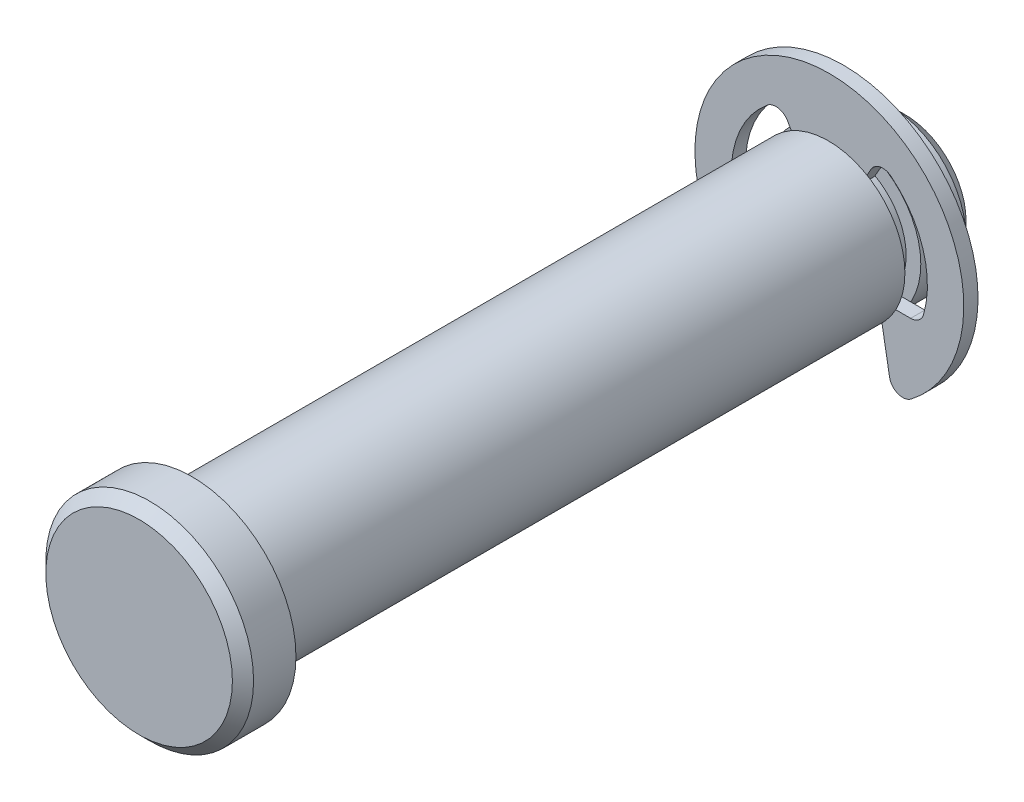
ISO-10303-21;
HEADER;
FILE_DESCRIPTION(('STEP AP214'),'2;1');
FILE_NAME('part.step','',(''),(''),'','','');
FILE_SCHEMA(('AUTOMOTIVE_DESIGN { 1 0 10303 214 1 1 1 1 }'));
ENDSEC;
DATA;
#1=APPLICATION_CONTEXT('core data for automotive mechanical design processes');
#2=APPLICATION_PROTOCOL_DEFINITION('international standard','automotive_design',2000,#1);
#3=PRODUCT_CONTEXT('',#1,'mechanical');
#4=PRODUCT('Part','Part','',(#3));
#5=PRODUCT_RELATED_PRODUCT_CATEGORY('part','',(#4));
#6=PRODUCT_DEFINITION_FORMATION('','',#4);
#7=PRODUCT_DEFINITION_CONTEXT('part definition',#1,'design');
#8=PRODUCT_DEFINITION('design','',#6,#7);
#9=PRODUCT_DEFINITION_SHAPE('','',#8);
#10=(LENGTH_UNIT() NAMED_UNIT(*) SI_UNIT(.MILLI.,.METRE.));
#11=(NAMED_UNIT(*) PLANE_ANGLE_UNIT() SI_UNIT($,.RADIAN.));
#12=(NAMED_UNIT(*) SI_UNIT($,.STERADIAN.) SOLID_ANGLE_UNIT());
#13=UNCERTAINTY_MEASURE_WITH_UNIT(LENGTH_MEASURE(1.E-05),#10,'distance_accuracy_value','');
#14=(GEOMETRIC_REPRESENTATION_CONTEXT(3) GLOBAL_UNCERTAINTY_ASSIGNED_CONTEXT((#13)) GLOBAL_UNIT_ASSIGNED_CONTEXT((#10,
#11,#12)) REPRESENTATION_CONTEXT('',''));
#15=CARTESIAN_POINT('',(0.,0.,0.));
#16=DIRECTION('',(0.,0.,1.));
#17=DIRECTION('',(1.,0.,0.));
#18=AXIS2_PLACEMENT_3D('',#15,#16,#17);
#19=CARTESIAN_POINT('',(0.,0.,-17.5133));
#20=DIRECTION('',(0.,0.,1.));
#21=DIRECTION('',(1.,0.,0.));
#22=AXIS2_PLACEMENT_3D('',#19,#20,#21);
#23=PLANE('',#22);
#24=DIRECTION('',(-0.173648177666931,0.984807753012208,0.));
#25=VECTOR('',#24,1.);
#26=CARTESIAN_POINT('',(2.59081415555905,0.45683043762648,-17.5133));
#27=LINE('',#26,#25);
#28=CARTESIAN_POINT('',(3.7540636467653,-6.14028525353106,-17.5133));
#29=VERTEX_POINT('',#28);
#30=CARTESIAN_POINT('',(3.07848,-2.30886,-17.5133));
#31=VERTEX_POINT('',#30);
#32=EDGE_CURVE('E203',#29,#31,#27,.T.);
#33=ORIENTED_EDGE('',*,*,#32,.F.);
#34=CARTESIAN_POINT('',(4.57952950534013,-5.99473335101063,-17.5133));
#35=DIRECTION('',(0.,0.,1.));
#36=DIRECTION('',(1.,0.,0.));
#37=AXIS2_PLACEMENT_3D('',#34,#35,#36);
#38=CIRCLE('',#37,0.8382);
#39=CARTESIAN_POINT('',(5.08836611704459,-6.66081483445626,-17.5133));
#40=VERTEX_POINT('',#39);
#41=EDGE_CURVE('E257',#29,#40,#38,.T.);
#42=ORIENTED_EDGE('',*,*,#41,.T.);
#43=CARTESIAN_POINT('',(0.,0.,-17.5133));
#44=DIRECTION('',(0.,0.,1.));
#45=DIRECTION('',(1.,0.,0.));
#46=AXIS2_PLACEMENT_3D('',#43,#44,#45);
#47=CIRCLE('',#46,8.382);
#48=CARTESIAN_POINT('',(-5.08836611704459,-6.66081483445626,-17.5133));
#49=VERTEX_POINT('',#48);
#50=EDGE_CURVE('E183',#40,#49,#47,.T.);
#51=ORIENTED_EDGE('',*,*,#50,.T.);
#52=CARTESIAN_POINT('',(-4.57952950534013,-5.99473335101063,-17.5133));
#53=DIRECTION('',(0.,0.,1.));
#54=DIRECTION('',(1.,0.,0.));
#55=AXIS2_PLACEMENT_3D('',#52,#53,#54);
#56=CIRCLE('',#55,0.8382);
#57=CARTESIAN_POINT('',(-3.7540636467653,-6.14028525353106,-17.5133));
#58=VERTEX_POINT('',#57);
#59=EDGE_CURVE('E255',#49,#58,#56,.T.);
#60=ORIENTED_EDGE('',*,*,#59,.T.);
#61=DIRECTION('',(-0.173648177666931,-0.984807753012208,0.));
#62=VECTOR('',#61,1.);
#63=CARTESIAN_POINT('',(-2.59081415555905,0.45683043762648,-17.5133));
#64=LINE('',#63,#62);
#65=CARTESIAN_POINT('',(-3.07848,-2.30886,-17.5133));
#66=VERTEX_POINT('',#65);
#67=EDGE_CURVE('E199',#66,#58,#64,.T.);
#68=ORIENTED_EDGE('',*,*,#67,.F.);
#69=DIRECTION('',(1.,0.,0.));
#70=VECTOR('',#69,1.);
#71=CARTESIAN_POINT('',(0.,-2.30886,-17.5133));
#72=LINE('',#71,#70);
#73=CARTESIAN_POINT('',(-5.06777121493266,-2.30886,-17.5133));
#74=VERTEX_POINT('',#73);
#75=EDGE_CURVE('E190',#74,#66,#72,.T.);
#76=ORIENTED_EDGE('',*,*,#75,.F.);
#77=CARTESIAN_POINT('',(-5.06777121493266,-1.47066,-17.5133));
#78=DIRECTION('',(0.,0.,1.));
#79=DIRECTION('',(1.,0.,0.));
#80=AXIS2_PLACEMENT_3D('',#77,#78,#79);
#81=CIRCLE('',#80,0.8382);
#82=CARTESIAN_POINT('',(-5.87276014438044,-1.70426664259928,-17.5133));
#83=VERTEX_POINT('',#82);
#84=EDGE_CURVE('E55',#74,#83,#81,.F.);
#85=ORIENTED_EDGE('',*,*,#84,.T.);
#86=CARTESIAN_POINT('',(0.,0.,-17.5133));
#87=DIRECTION('',(0.,0.,1.));
#88=DIRECTION('',(1.,0.,0.));
#89=AXIS2_PLACEMENT_3D('',#86,#87,#88);
#90=CIRCLE('',#89,6.11505);
#91=CARTESIAN_POINT('',(-3.85991365439078,4.74287919761273,-17.5133));
#92=VERTEX_POINT('',#91);
#93=EDGE_CURVE('E215',#92,#83,#90,.T.);
#94=ORIENTED_EDGE('',*,*,#93,.F.);
#95=CARTESIAN_POINT('',(-3.33082891671728,4.09276491507392,-17.5133));
#96=DIRECTION('',(0.,0.,1.));
#97=DIRECTION('',(1.,0.,0.));
#98=AXIS2_PLACEMENT_3D('',#95,#96,#97);
#99=CIRCLE('',#98,0.8382);
#100=CARTESIAN_POINT('',(-2.60492642326516,4.51186491507392,-17.5133));
#101=VERTEX_POINT('',#100);
#102=EDGE_CURVE('E187',#92,#101,#99,.F.);
#103=ORIENTED_EDGE('',*,*,#102,.T.);
#104=DIRECTION('',(-0.500000000000001,0.866025403784438,0.));
#105=VECTOR('',#104,1.);
#106=CARTESIAN_POINT('',(0.,0.,-17.5133));
#107=LINE('',#106,#105);
#108=CARTESIAN_POINT('',(-1.92405000000001,3.3325523563029,-17.5133));
#109=VERTEX_POINT('',#108);
#110=EDGE_CURVE('E179',#109,#101,#107,.T.);
#111=ORIENTED_EDGE('',*,*,#110,.F.);
#112=DIRECTION('',(1.,0.,0.));
#113=VECTOR('',#112,1.);
#114=CARTESIAN_POINT('',(-1.92405000000001,3.3325523563029,-17.5133));
#115=LINE('',#114,#113);
#116=CARTESIAN_POINT('',(1.92405000000001,3.3325523563029,-17.5133));
#117=VERTEX_POINT('',#116);
#118=EDGE_CURVE('E163',#109,#117,#115,.T.);
#119=ORIENTED_EDGE('',*,*,#118,.T.);
#120=DIRECTION('',(-0.500000000000001,-0.866025403784438,0.));
#121=VECTOR('',#120,1.);
#122=CARTESIAN_POINT('',(0.,0.,-17.5133));
#123=LINE('',#122,#121);
#124=CARTESIAN_POINT('',(2.60492642326516,4.51186491507392,-17.5133));
#125=VERTEX_POINT('',#124);
#126=EDGE_CURVE('E213',#125,#117,#123,.T.);
#127=ORIENTED_EDGE('',*,*,#126,.F.);
#128=CARTESIAN_POINT('',(3.33082891671728,4.09276491507392,-17.5133));
#129=DIRECTION('',(0.,0.,1.));
#130=DIRECTION('',(1.,0.,0.));
#131=AXIS2_PLACEMENT_3D('',#128,#129,#130);
#132=CIRCLE('',#131,0.8382);
#133=CARTESIAN_POINT('',(3.85991365439078,4.74287919761273,-17.5133));
#134=VERTEX_POINT('',#133);
#135=EDGE_CURVE('E272',#125,#134,#132,.F.);
#136=ORIENTED_EDGE('',*,*,#135,.T.);
#137=CARTESIAN_POINT('',(0.,0.,-17.5133));
#138=DIRECTION('',(0.,0.,1.));
#139=DIRECTION('',(1.,0.,0.));
#140=AXIS2_PLACEMENT_3D('',#137,#138,#139);
#141=CIRCLE('',#140,6.11505);
#142=CARTESIAN_POINT('',(5.87276014438044,-1.70426664259928,-17.5133));
#143=VERTEX_POINT('',#142);
#144=EDGE_CURVE('E218',#143,#134,#141,.T.);
#145=ORIENTED_EDGE('',*,*,#144,.F.);
#146=CARTESIAN_POINT('',(5.06777121493266,-1.47066,-17.5133));
#147=DIRECTION('',(0.,0.,1.));
#148=DIRECTION('',(1.,0.,0.));
#149=AXIS2_PLACEMENT_3D('',#146,#147,#148);
#150=CIRCLE('',#149,0.8382);
#151=CARTESIAN_POINT('',(5.06777121493266,-2.30886,-17.5133));
#152=VERTEX_POINT('',#151);
#153=EDGE_CURVE('E268',#143,#152,#150,.F.);
#154=ORIENTED_EDGE('',*,*,#153,.T.);
#155=DIRECTION('',(1.,0.,0.));
#156=VECTOR('',#155,1.);
#157=CARTESIAN_POINT('',(0.,-2.30886,-17.5133));
#158=LINE('',#157,#156);
#159=EDGE_CURVE('E208',#31,#152,#158,.T.);
#160=ORIENTED_EDGE('',*,*,#159,.F.);
#161=EDGE_LOOP('',(#33,#42,#51,#60,#68,#76,#85,#94,#103,#111,#119,#127,#136,#145,#154,#160));
#162=FACE_BOUND('',#161,.T.);
#163=ADVANCED_FACE('F47',(#162),#23,.T.);
#164=CARTESIAN_POINT('',(0.,0.,-18.4023));
#165=DIRECTION('',(0.,0.,1.));
#166=DIRECTION('',(1.,0.,0.));
#167=AXIS2_PLACEMENT_3D('',#164,#165,#166);
#168=PLANE('',#167);
#169=CARTESIAN_POINT('',(0.,0.,-18.4023));
#170=DIRECTION('',(0.,0.,1.));
#171=DIRECTION('',(1.,0.,0.));
#172=AXIS2_PLACEMENT_3D('',#169,#170,#171);
#173=CIRCLE('',#172,8.382);
#174=CARTESIAN_POINT('',(5.08836611704459,-6.66081483445626,-18.4023));
#175=VERTEX_POINT('',#174);
#176=CARTESIAN_POINT('',(-5.08836611704459,-6.66081483445626,-18.4023));
#177=VERTEX_POINT('',#176);
#178=EDGE_CURVE('E221',#175,#177,#173,.T.);
#179=ORIENTED_EDGE('',*,*,#178,.F.);
#180=CARTESIAN_POINT('',(4.57952950534013,-5.99473335101063,-18.4023));
#181=DIRECTION('',(0.,0.,1.));
#182=DIRECTION('',(1.,0.,0.));
#183=AXIS2_PLACEMENT_3D('',#180,#181,#182);
#184=CIRCLE('',#183,0.8382);
#185=CARTESIAN_POINT('',(3.7540636467653,-6.14028525353106,-18.4023));
#186=VERTEX_POINT('',#185);
#187=EDGE_CURVE('E265',#175,#186,#184,.F.);
#188=ORIENTED_EDGE('',*,*,#187,.T.);
#189=DIRECTION('',(-0.173648177666931,0.984807753012208,0.));
#190=VECTOR('',#189,1.);
#191=CARTESIAN_POINT('',(2.59081415555905,0.45683043762648,-18.4023));
#192=LINE('',#191,#190);
#193=CARTESIAN_POINT('',(3.07848,-2.30886,-18.4023));
#194=VERTEX_POINT('',#193);
#195=EDGE_CURVE('E201',#186,#194,#192,.T.);
#196=ORIENTED_EDGE('',*,*,#195,.T.);
#197=DIRECTION('',(1.,0.,0.));
#198=VECTOR('',#197,1.);
#199=CARTESIAN_POINT('',(0.,-2.30886,-18.4023));
#200=LINE('',#199,#198);
#201=CARTESIAN_POINT('',(5.06777121493266,-2.30886,-18.4023));
#202=VERTEX_POINT('',#201);
#203=EDGE_CURVE('E205',#194,#202,#200,.T.);
#204=ORIENTED_EDGE('',*,*,#203,.T.);
#205=CARTESIAN_POINT('',(5.06777121493266,-1.47066,-18.4023));
#206=DIRECTION('',(0.,0.,1.));
#207=DIRECTION('',(1.,0.,0.));
#208=AXIS2_PLACEMENT_3D('',#205,#206,#207);
#209=CIRCLE('',#208,0.8382);
#210=CARTESIAN_POINT('',(5.87276014438044,-1.70426664259928,-18.4023));
#211=VERTEX_POINT('',#210);
#212=EDGE_CURVE('E270',#202,#211,#209,.T.);
#213=ORIENTED_EDGE('',*,*,#212,.T.);
#214=CARTESIAN_POINT('',(0.,0.,-18.4023));
#215=DIRECTION('',(0.,0.,1.));
#216=DIRECTION('',(1.,0.,0.));
#217=AXIS2_PLACEMENT_3D('',#214,#215,#216);
#218=CIRCLE('',#217,6.11505);
#219=CARTESIAN_POINT('',(3.85991365439078,4.74287919761273,-18.4023));
#220=VERTEX_POINT('',#219);
#221=EDGE_CURVE('E229',#211,#220,#218,.T.);
#222=ORIENTED_EDGE('',*,*,#221,.T.);
#223=CARTESIAN_POINT('',(3.33082891671728,4.09276491507392,-18.4023));
#224=DIRECTION('',(0.,0.,1.));
#225=DIRECTION('',(1.,0.,0.));
#226=AXIS2_PLACEMENT_3D('',#223,#224,#225);
#227=CIRCLE('',#226,0.8382);
#228=CARTESIAN_POINT('',(2.60492642326516,4.51186491507392,-18.4023));
#229=VERTEX_POINT('',#228);
#230=EDGE_CURVE('E274',#220,#229,#227,.T.);
#231=ORIENTED_EDGE('',*,*,#230,.T.);
#232=DIRECTION('',(-0.500000000000001,-0.866025403784438,0.));
#233=VECTOR('',#232,1.);
#234=CARTESIAN_POINT('',(0.,0.,-18.4023));
#235=LINE('',#234,#233);
#236=CARTESIAN_POINT('',(1.92405000000001,3.33255235630289,-18.4023));
#237=VERTEX_POINT('',#236);
#238=EDGE_CURVE('E211',#229,#237,#235,.T.);
#239=ORIENTED_EDGE('',*,*,#238,.T.);
#240=DIRECTION('',(-1.,0.,0.));
#241=VECTOR('',#240,1.);
#242=CARTESIAN_POINT('',(-1.92405000000001,3.3325523563029,-18.4023));
#243=LINE('',#242,#241);
#244=CARTESIAN_POINT('',(-1.92405000000001,3.3325523563029,-18.4023));
#245=VERTEX_POINT('',#244);
#246=EDGE_CURVE('E174',#237,#245,#243,.T.);
#247=ORIENTED_EDGE('',*,*,#246,.T.);
#248=DIRECTION('',(-0.500000000000001,0.866025403784438,0.));
#249=VECTOR('',#248,1.);
#250=CARTESIAN_POINT('',(0.,0.,-18.4023));
#251=LINE('',#250,#249);
#252=CARTESIAN_POINT('',(-2.60492642326516,4.51186491507392,-18.4023));
#253=VERTEX_POINT('',#252);
#254=EDGE_CURVE('E182',#245,#253,#251,.T.);
#255=ORIENTED_EDGE('',*,*,#254,.T.);
#256=CARTESIAN_POINT('',(-3.33082891671728,4.09276491507392,-18.4023));
#257=DIRECTION('',(0.,0.,1.));
#258=DIRECTION('',(1.,0.,0.));
#259=AXIS2_PLACEMENT_3D('',#256,#257,#258);
#260=CIRCLE('',#259,0.8382);
#261=CARTESIAN_POINT('',(-3.85991365439078,4.74287919761273,-18.4023));
#262=VERTEX_POINT('',#261);
#263=EDGE_CURVE('E277',#253,#262,#260,.T.);
#264=ORIENTED_EDGE('',*,*,#263,.T.);
#265=CARTESIAN_POINT('',(0.,0.,-18.4023));
#266=DIRECTION('',(0.,0.,1.));
#267=DIRECTION('',(1.,0.,0.));
#268=AXIS2_PLACEMENT_3D('',#265,#266,#267);
#269=CIRCLE('',#268,6.11505);
#270=CARTESIAN_POINT('',(-5.87276014438044,-1.70426664259928,-18.4023));
#271=VERTEX_POINT('',#270);
#272=EDGE_CURVE('E226',#262,#271,#269,.T.);
#273=ORIENTED_EDGE('',*,*,#272,.T.);
#274=CARTESIAN_POINT('',(-5.06777121493266,-1.47066,-18.4023));
#275=DIRECTION('',(0.,0.,1.));
#276=DIRECTION('',(1.,0.,0.));
#277=AXIS2_PLACEMENT_3D('',#274,#275,#276);
#278=CIRCLE('',#277,0.8382);
#279=CARTESIAN_POINT('',(-5.06777121493266,-2.30886,-18.4023));
#280=VERTEX_POINT('',#279);
#281=EDGE_CURVE('E12',#271,#280,#278,.T.);
#282=ORIENTED_EDGE('',*,*,#281,.T.);
#283=DIRECTION('',(1.,0.,0.));
#284=VECTOR('',#283,1.);
#285=CARTESIAN_POINT('',(0.,-2.30886,-18.4023));
#286=LINE('',#285,#284);
#287=CARTESIAN_POINT('',(-3.07848,-2.30886,-18.4023));
#288=VERTEX_POINT('',#287);
#289=EDGE_CURVE('E188',#280,#288,#286,.T.);
#290=ORIENTED_EDGE('',*,*,#289,.T.);
#291=DIRECTION('',(-0.173648177666931,-0.984807753012208,0.));
#292=VECTOR('',#291,1.);
#293=CARTESIAN_POINT('',(-2.59081415555905,0.45683043762648,-18.4023));
#294=LINE('',#293,#292);
#295=CARTESIAN_POINT('',(-3.7540636467653,-6.14028525353106,-18.4023));
#296=VERTEX_POINT('',#295);
#297=EDGE_CURVE('E197',#288,#296,#294,.T.);
#298=ORIENTED_EDGE('',*,*,#297,.T.);
#299=CARTESIAN_POINT('',(-4.57952950534013,-5.99473335101063,-18.4023));
#300=DIRECTION('',(0.,0.,1.));
#301=DIRECTION('',(1.,0.,0.));
#302=AXIS2_PLACEMENT_3D('',#299,#300,#301);
#303=CIRCLE('',#302,0.8382);
#304=EDGE_CURVE('E69',#296,#177,#303,.F.);
#305=ORIENTED_EDGE('',*,*,#304,.T.);
#306=EDGE_LOOP('',(#179,#188,#196,#204,#213,#222,#231,#239,#247,#255,#264,#273,#282,#290,#298,#305));
#307=FACE_BOUND('',#306,.T.);
#308=ADVANCED_FACE('F290',(#307),#168,.F.);
#309=CARTESIAN_POINT('',(0.,0.,-17.5133));
#310=DIRECTION('',(0.,0.,-1.));
#311=DIRECTION('',(-1.,0.,0.));
#312=AXIS2_PLACEMENT_3D('',#309,#310,#311);
#313=CYLINDRICAL_SURFACE('',#312,8.382);
#314=ORIENTED_EDGE('',*,*,#50,.F.);
#315=DIRECTION('',(0.,0.,-1.));
#316=VECTOR('',#315,1.);
#317=CARTESIAN_POINT('',(5.08836611704459,-6.66081483445626,-17.5133));
#318=LINE('',#317,#316);
#319=EDGE_CURVE('E262',#40,#175,#318,.T.);
#320=ORIENTED_EDGE('',*,*,#319,.T.);
#321=ORIENTED_EDGE('',*,*,#178,.T.);
#322=DIRECTION('',(0.,0.,-1.));
#323=VECTOR('',#322,1.);
#324=CARTESIAN_POINT('',(-5.08836611704459,-6.66081483445626,-17.5133));
#325=LINE('',#324,#323);
#326=EDGE_CURVE('E259',#177,#49,#325,.F.);
#327=ORIENTED_EDGE('',*,*,#326,.T.);
#328=EDGE_LOOP('',(#314,#320,#321,#327));
#329=FACE_BOUND('',#328,.T.);
#330=ADVANCED_FACE('F330',(#329),#313,.T.);
#331=CARTESIAN_POINT('',(-3.07848,-2.30886,-22.225));
#332=DIRECTION('',(-0.984807753012208,0.173648177666931,0.));
#333=DIRECTION('',(-0.173648177666931,-0.984807753012208,0.));
#334=AXIS2_PLACEMENT_3D('',#331,#332,#333);
#335=PLANE('',#334);
#336=ORIENTED_EDGE('',*,*,#67,.T.);
#337=DIRECTION('',(0.,0.,-1.));
#338=VECTOR('',#337,1.);
#339=CARTESIAN_POINT('',(-3.7540636467653,-6.14028525353106,-22.225));
#340=LINE('',#339,#338);
#341=EDGE_CURVE('E62',#58,#296,#340,.T.);
#342=ORIENTED_EDGE('',*,*,#341,.T.);
#343=ORIENTED_EDGE('',*,*,#297,.F.);
#344=DIRECTION('',(0.,0.,1.));
#345=VECTOR('',#344,1.);
#346=CARTESIAN_POINT('',(-3.07848,-2.30886,-22.225));
#347=LINE('',#346,#345);
#348=EDGE_CURVE('E295',#288,#66,#347,.T.);
#349=ORIENTED_EDGE('',*,*,#348,.T.);
#350=EDGE_LOOP('',(#336,#342,#343,#349));
#351=FACE_BOUND('',#350,.T.);
#352=ADVANCED_FACE('F335',(#351),#335,.F.);
#353=CARTESIAN_POINT('',(-3.05752500000001,5.29578864541203,-22.225));
#354=DIRECTION('',(0.866025403784438,0.500000000000001,0.));
#355=DIRECTION('',(-0.500000000000001,0.866025403784438,0.));
#356=AXIS2_PLACEMENT_3D('',#353,#354,#355);
#357=PLANE('',#356);
#358=ORIENTED_EDGE('',*,*,#110,.T.);
#359=DIRECTION('',(0.,0.,-1.));
#360=VECTOR('',#359,1.);
#361=CARTESIAN_POINT('',(-2.60492642326516,4.51186491507392,-18.4023));
#362=LINE('',#361,#360);
#363=EDGE_CURVE('E247',#101,#253,#362,.T.);
#364=ORIENTED_EDGE('',*,*,#363,.T.);
#365=ORIENTED_EDGE('',*,*,#254,.F.);
#366=DIRECTION('',(0.,0.,-1.));
#367=VECTOR('',#366,1.);
#368=CARTESIAN_POINT('',(-1.92405000000001,3.33255235630289,-17.5133));
#369=LINE('',#368,#367);
#370=EDGE_CURVE('E167',#245,#109,#369,.F.);
#371=ORIENTED_EDGE('',*,*,#370,.T.);
#372=EDGE_LOOP('',(#358,#364,#365,#371));
#373=FACE_BOUND('',#372,.T.);
#374=ADVANCED_FACE('F178',(#373),#357,.F.);
#375=CARTESIAN_POINT('',(0.,0.,-22.225));
#376=DIRECTION('',(0.,0.,1.));
#377=DIRECTION('',(1.,0.,0.));
#378=AXIS2_PLACEMENT_3D('',#375,#376,#377);
#379=CYLINDRICAL_SURFACE('',#378,6.11505);
#380=ORIENTED_EDGE('',*,*,#272,.F.);
#381=DIRECTION('',(0.,0.,1.));
#382=VECTOR('',#381,1.);
#383=CARTESIAN_POINT('',(-3.85991365439078,4.74287919761273,-22.225));
#384=LINE('',#383,#382);
#385=EDGE_CURVE('E244',#262,#92,#384,.T.);
#386=ORIENTED_EDGE('',*,*,#385,.T.);
#387=ORIENTED_EDGE('',*,*,#93,.T.);
#388=DIRECTION('',(0.,0.,1.));
#389=VECTOR('',#388,1.);
#390=CARTESIAN_POINT('',(-5.87276014438044,-1.70426664259928,-22.225));
#391=LINE('',#390,#389);
#392=EDGE_CURVE('E242',#83,#271,#391,.F.);
#393=ORIENTED_EDGE('',*,*,#392,.T.);
#394=EDGE_LOOP('',(#380,#386,#387,#393));
#395=FACE_BOUND('',#394,.T.);
#396=ADVANCED_FACE('F285',(#395),#379,.F.);
#397=CARTESIAN_POINT('',(-5.66242015421851,-2.30886,-22.225));
#398=DIRECTION('',(0.,-1.,0.));
#399=DIRECTION('',(0.,0.,-1.));
#400=AXIS2_PLACEMENT_3D('',#397,#398,#399);
#401=PLANE('',#400);
#402=ORIENTED_EDGE('',*,*,#289,.F.);
#403=DIRECTION('',(0.,0.,-1.));
#404=VECTOR('',#403,1.);
#405=CARTESIAN_POINT('',(-5.06777121493266,-2.30886,-17.5133));
#406=LINE('',#405,#404);
#407=EDGE_CURVE('E249',#280,#74,#406,.F.);
#408=ORIENTED_EDGE('',*,*,#407,.T.);
#409=ORIENTED_EDGE('',*,*,#75,.T.);
#410=ORIENTED_EDGE('',*,*,#348,.F.);
#411=EDGE_LOOP('',(#402,#408,#409,#410));
#412=FACE_BOUND('',#411,.T.);
#413=ADVANCED_FACE('F293',(#412),#401,.F.);
#414=CARTESIAN_POINT('',(0.,0.,-22.225));
#415=DIRECTION('',(0.,0.,1.));
#416=DIRECTION('',(1.,0.,0.));
#417=AXIS2_PLACEMENT_3D('',#414,#415,#416);
#418=CYLINDRICAL_SURFACE('',#417,6.11505);
#419=ORIENTED_EDGE('',*,*,#221,.F.);
#420=DIRECTION('',(0.,0.,1.));
#421=VECTOR('',#420,1.);
#422=CARTESIAN_POINT('',(5.87276014438044,-1.70426664259928,-22.225));
#423=LINE('',#422,#421);
#424=EDGE_CURVE('E234',#211,#143,#423,.T.);
#425=ORIENTED_EDGE('',*,*,#424,.T.);
#426=ORIENTED_EDGE('',*,*,#144,.T.);
#427=DIRECTION('',(0.,0.,1.));
#428=VECTOR('',#427,1.);
#429=CARTESIAN_POINT('',(3.85991365439078,4.74287919761273,-22.225));
#430=LINE('',#429,#428);
#431=EDGE_CURVE('E232',#134,#220,#430,.F.);
#432=ORIENTED_EDGE('',*,*,#431,.T.);
#433=EDGE_LOOP('',(#419,#425,#426,#432));
#434=FACE_BOUND('',#433,.T.);
#435=ADVANCED_FACE('F309',(#434),#418,.F.);
#436=CARTESIAN_POINT('',(3.07848,-2.30886,-22.225));
#437=DIRECTION('',(0.,-1.,0.));
#438=DIRECTION('',(0.,0.,-1.));
#439=AXIS2_PLACEMENT_3D('',#436,#437,#438);
#440=PLANE('',#439);
#441=ORIENTED_EDGE('',*,*,#159,.T.);
#442=DIRECTION('',(0.,0.,-1.));
#443=VECTOR('',#442,1.);
#444=CARTESIAN_POINT('',(5.06777121493266,-2.30886,-18.4023));
#445=LINE('',#444,#443);
#446=EDGE_CURVE('E237',#152,#202,#445,.T.);
#447=ORIENTED_EDGE('',*,*,#446,.T.);
#448=ORIENTED_EDGE('',*,*,#203,.F.);
#449=DIRECTION('',(0.,0.,1.));
#450=VECTOR('',#449,1.);
#451=CARTESIAN_POINT('',(3.07848,-2.30886,-22.225));
#452=LINE('',#451,#450);
#453=EDGE_CURVE('E192',#194,#31,#452,.T.);
#454=ORIENTED_EDGE('',*,*,#453,.T.);
#455=EDGE_LOOP('',(#441,#447,#448,#454));
#456=FACE_BOUND('',#455,.T.);
#457=ADVANCED_FACE('F319',(#456),#440,.F.);
#458=CARTESIAN_POINT('',(3.07848,-2.30886,-22.225));
#459=DIRECTION('',(0.984807753012208,0.173648177666931,0.));
#460=DIRECTION('',(-0.173648177666931,0.984807753012208,0.));
#461=AXIS2_PLACEMENT_3D('',#458,#459,#460);
#462=PLANE('',#461);
#463=ORIENTED_EDGE('',*,*,#195,.F.);
#464=DIRECTION('',(0.,0.,-1.));
#465=VECTOR('',#464,1.);
#466=CARTESIAN_POINT('',(3.7540636467653,-6.14028525353106,-22.225));
#467=LINE('',#466,#465);
#468=EDGE_CURVE('E252',#186,#29,#467,.F.);
#469=ORIENTED_EDGE('',*,*,#468,.T.);
#470=ORIENTED_EDGE('',*,*,#32,.T.);
#471=ORIENTED_EDGE('',*,*,#453,.F.);
#472=EDGE_LOOP('',(#463,#469,#470,#471));
#473=FACE_BOUND('',#472,.T.);
#474=ADVANCED_FACE('F324',(#473),#462,.F.);
#475=CARTESIAN_POINT('',(0.,0.,-22.225));
#476=DIRECTION('',(-0.866025403784438,0.500000000000001,0.));
#477=DIRECTION('',(-0.500000000000001,-0.866025403784438,0.));
#478=AXIS2_PLACEMENT_3D('',#475,#476,#477);
#479=PLANE('',#478);
#480=ORIENTED_EDGE('',*,*,#238,.F.);
#481=DIRECTION('',(0.,0.,-1.));
#482=VECTOR('',#481,1.);
#483=CARTESIAN_POINT('',(2.60492642326516,4.51186491507392,-17.5133));
#484=LINE('',#483,#482);
#485=EDGE_CURVE('E239',#229,#125,#484,.F.);
#486=ORIENTED_EDGE('',*,*,#485,.T.);
#487=ORIENTED_EDGE('',*,*,#126,.T.);
#488=DIRECTION('',(0.,0.,-1.));
#489=VECTOR('',#488,1.);
#490=CARTESIAN_POINT('',(1.92405000000001,3.33255235630289,-17.5133));
#491=LINE('',#490,#489);
#492=EDGE_CURVE('E170',#117,#237,#491,.T.);
#493=ORIENTED_EDGE('',*,*,#492,.T.);
#494=EDGE_LOOP('',(#480,#486,#487,#493));
#495=FACE_BOUND('',#494,.T.);
#496=ADVANCED_FACE('F302',(#495),#479,.F.);
#497=CARTESIAN_POINT('',(-1.92405000000001,3.3325523563029,-22.2847815495919));
#498=DIRECTION('',(0.,-1.,0.));
#499=DIRECTION('',(0.,0.,-1.));
#500=AXIS2_PLACEMENT_3D('',#497,#498,#499);
#501=PLANE('',#500);
#502=ORIENTED_EDGE('',*,*,#246,.F.);
#503=ORIENTED_EDGE('',*,*,#492,.F.);
#504=ORIENTED_EDGE('',*,*,#118,.F.);
#505=ORIENTED_EDGE('',*,*,#370,.F.);
#506=EDGE_LOOP('',(#502,#503,#504,#505));
#507=FACE_BOUND('',#506,.T.);
#508=ADVANCED_FACE('F166',(#507),#501,.T.);
#509=CARTESIAN_POINT('',(5.06777121493266,-1.47066,-22.225));
#510=DIRECTION('',(0.,0.,1.));
#511=DIRECTION('',(1.,0.,0.));
#512=AXIS2_PLACEMENT_3D('',#509,#510,#511);
#513=CYLINDRICAL_SURFACE('',#512,0.8382);
#514=ORIENTED_EDGE('',*,*,#212,.F.);
#515=ORIENTED_EDGE('',*,*,#446,.F.);
#516=ORIENTED_EDGE('',*,*,#153,.F.);
#517=ORIENTED_EDGE('',*,*,#424,.F.);
#518=EDGE_LOOP('',(#514,#515,#516,#517));
#519=FACE_BOUND('',#518,.T.);
#520=ADVANCED_FACE('F315',(#519),#513,.F.);
#521=CARTESIAN_POINT('',(3.33082891671728,4.09276491507392,-22.225));
#522=DIRECTION('',(0.,0.,1.));
#523=DIRECTION('',(1.,0.,0.));
#524=AXIS2_PLACEMENT_3D('',#521,#522,#523);
#525=CYLINDRICAL_SURFACE('',#524,0.8382);
#526=ORIENTED_EDGE('',*,*,#230,.F.);
#527=ORIENTED_EDGE('',*,*,#431,.F.);
#528=ORIENTED_EDGE('',*,*,#135,.F.);
#529=ORIENTED_EDGE('',*,*,#485,.F.);
#530=EDGE_LOOP('',(#526,#527,#528,#529));
#531=FACE_BOUND('',#530,.T.);
#532=ADVANCED_FACE('F312',(#531),#525,.F.);
#533=CARTESIAN_POINT('',(-3.33082891671728,4.09276491507392,-22.225));
#534=DIRECTION('',(0.,0.,1.));
#535=DIRECTION('',(1.,0.,0.));
#536=AXIS2_PLACEMENT_3D('',#533,#534,#535);
#537=CYLINDRICAL_SURFACE('',#536,0.8382);
#538=ORIENTED_EDGE('',*,*,#263,.F.);
#539=ORIENTED_EDGE('',*,*,#363,.F.);
#540=ORIENTED_EDGE('',*,*,#102,.F.);
#541=ORIENTED_EDGE('',*,*,#385,.F.);
#542=EDGE_LOOP('',(#538,#539,#540,#541));
#543=FACE_BOUND('',#542,.T.);
#544=ADVANCED_FACE('F359',(#543),#537,.F.);
#545=CARTESIAN_POINT('',(-5.06777121493266,-1.47066,-22.225));
#546=DIRECTION('',(0.,0.,1.));
#547=DIRECTION('',(1.,0.,0.));
#548=AXIS2_PLACEMENT_3D('',#545,#546,#547);
#549=CYLINDRICAL_SURFACE('',#548,0.8382);
#550=ORIENTED_EDGE('',*,*,#281,.F.);
#551=ORIENTED_EDGE('',*,*,#392,.F.);
#552=ORIENTED_EDGE('',*,*,#84,.F.);
#553=ORIENTED_EDGE('',*,*,#407,.F.);
#554=EDGE_LOOP('',(#550,#551,#552,#553));
#555=FACE_BOUND('',#554,.T.);
#556=ADVANCED_FACE('F288',(#555),#549,.F.);
#557=CARTESIAN_POINT('',(4.57952950534013,-5.99473335101063,-17.5133));
#558=DIRECTION('',(0.,0.,-1.));
#559=DIRECTION('',(-1.,0.,0.));
#560=AXIS2_PLACEMENT_3D('',#557,#558,#559);
#561=CYLINDRICAL_SURFACE('',#560,0.8382);
#562=ORIENTED_EDGE('',*,*,#187,.F.);
#563=ORIENTED_EDGE('',*,*,#319,.F.);
#564=ORIENTED_EDGE('',*,*,#41,.F.);
#565=ORIENTED_EDGE('',*,*,#468,.F.);
#566=EDGE_LOOP('',(#562,#563,#564,#565));
#567=FACE_BOUND('',#566,.T.);
#568=ADVANCED_FACE('F333',(#567),#561,.T.);
#569=CARTESIAN_POINT('',(-4.57952950534013,-5.99473335101063,-17.5133));
#570=DIRECTION('',(0.,0.,-1.));
#571=DIRECTION('',(-1.,0.,0.));
#572=AXIS2_PLACEMENT_3D('',#569,#570,#571);
#573=CYLINDRICAL_SURFACE('',#572,0.8382);
#574=ORIENTED_EDGE('',*,*,#304,.F.);
#575=ORIENTED_EDGE('',*,*,#341,.F.);
#576=ORIENTED_EDGE('',*,*,#59,.F.);
#577=ORIENTED_EDGE('',*,*,#326,.F.);
#578=EDGE_LOOP('',(#574,#575,#576,#577));
#579=FACE_BOUND('',#578,.T.);
#580=ADVANCED_FACE('F49',(#579),#573,.T.);
#581=CLOSED_SHELL('',(#163,#308,#330,#352,#374,#396,#413,#435,#457,#474,#496,#508,#520,#532,
#544,#556,#568,#580));
#582=MANIFOLD_SOLID_BREP('B2',#581);
#583=CARTESIAN_POINT('',(0.,0.,22.225));
#584=DIRECTION('',(0.,0.,-1.));
#585=DIRECTION('',(-1.,0.,0.));
#586=AXIS2_PLACEMENT_3D('',#583,#584,#585);
#587=CYLINDRICAL_SURFACE('',#586,4.7625);
#588=CARTESIAN_POINT('',(0.,0.,22.225));
#589=DIRECTION('',(0.,0.,1.));
#590=DIRECTION('',(1.,0.,0.));
#591=AXIS2_PLACEMENT_3D('',#588,#589,#590);
#592=CIRCLE('',#591,4.7625);
#593=CARTESIAN_POINT('',(4.7625,0.,22.225));
#594=VERTEX_POINT('',#593);
#595=EDGE_CURVE('E473',#594,#594,#592,.T.);
#596=ORIENTED_EDGE('',*,*,#595,.F.);
#597=EDGE_LOOP('',(#596));
#598=FACE_BOUND('',#597,.T.);
#599=CARTESIAN_POINT('',(0.,0.,-17.4625));
#600=DIRECTION('',(0.,0.,1.));
#601=DIRECTION('',(1.,0.,0.));
#602=AXIS2_PLACEMENT_3D('',#599,#600,#601);
#603=CIRCLE('',#602,4.7625);
#604=CARTESIAN_POINT('',(4.7625,0.,-17.4625));
#605=VERTEX_POINT('',#604);
#606=EDGE_CURVE('E485',#605,#605,#603,.T.);
#607=ORIENTED_EDGE('',*,*,#606,.T.);
#608=EDGE_LOOP('',(#607));
#609=FACE_BOUND('',#608,.T.);
#610=ADVANCED_FACE('F453',(#598,#609),#587,.T.);
#611=CARTESIAN_POINT('',(0.,4.7625,-17.4625));
#612=DIRECTION('',(0.,0.,-1.));
#613=DIRECTION('',(-1.,0.,0.));
#614=AXIS2_PLACEMENT_3D('',#611,#612,#613);
#615=PLANE('',#614);
#616=CARTESIAN_POINT('',(0.,0.,-17.4625));
#617=DIRECTION('',(0.,0.,1.));
#618=DIRECTION('',(1.,0.,0.));
#619=AXIS2_PLACEMENT_3D('',#616,#617,#618);
#620=CIRCLE('',#619,3.8481);
#621=CARTESIAN_POINT('',(3.8481,0.,-17.4625));
#622=VERTEX_POINT('',#621);
#623=EDGE_CURVE('E476',#622,#622,#620,.T.);
#624=ORIENTED_EDGE('',*,*,#623,.T.);
#625=EDGE_LOOP('',(#624));
#626=FACE_BOUND('',#625,.T.);
#627=ORIENTED_EDGE('',*,*,#606,.F.);
#628=EDGE_LOOP('',(#627));
#629=FACE_BOUND('',#628,.T.);
#630=ADVANCED_FACE('F503',(#626,#629),#615,.T.);
#631=CARTESIAN_POINT('',(0.,0.,22.225));
#632=DIRECTION('',(0.,0.,1.));
#633=DIRECTION('',(1.,0.,0.));
#634=AXIS2_PLACEMENT_3D('',#631,#632,#633);
#635=CYLINDRICAL_SURFACE('',#634,3.8481);
#636=CARTESIAN_POINT('',(0.,0.,-18.4531));
#637=DIRECTION('',(0.,0.,1.));
#638=DIRECTION('',(1.,0.,0.));
#639=AXIS2_PLACEMENT_3D('',#636,#637,#638);
#640=CIRCLE('',#639,3.8481);
#641=CARTESIAN_POINT('',(3.8481,0.,-18.4531));
#642=VERTEX_POINT('',#641);
#643=EDGE_CURVE('E479',#642,#642,#640,.T.);
#644=ORIENTED_EDGE('',*,*,#643,.T.);
#645=EDGE_LOOP('',(#644));
#646=FACE_BOUND('',#645,.T.);
#647=ORIENTED_EDGE('',*,*,#623,.F.);
#648=EDGE_LOOP('',(#647));
#649=FACE_BOUND('',#648,.T.);
#650=ADVANCED_FACE('F508',(#646,#649),#635,.T.);
#651=CARTESIAN_POINT('',(0.,4.7625,-18.4531));
#652=DIRECTION('',(0.,0.,1.));
#653=DIRECTION('',(1.,0.,0.));
#654=AXIS2_PLACEMENT_3D('',#651,#652,#653);
#655=PLANE('',#654);
#656=CARTESIAN_POINT('',(0.,0.,-18.4531));
#657=DIRECTION('',(0.,0.,1.));
#658=DIRECTION('',(1.,0.,0.));
#659=AXIS2_PLACEMENT_3D('',#656,#657,#658);
#660=CIRCLE('',#659,4.7625);
#661=CARTESIAN_POINT('',(4.7625,0.,-18.4531));
#662=VERTEX_POINT('',#661);
#663=EDGE_CURVE('E482',#662,#662,#660,.T.);
#664=ORIENTED_EDGE('',*,*,#663,.T.);
#665=EDGE_LOOP('',(#664));
#666=FACE_BOUND('',#665,.T.);
#667=ORIENTED_EDGE('',*,*,#643,.F.);
#668=EDGE_LOOP('',(#667));
#669=FACE_BOUND('',#668,.T.);
#670=ADVANCED_FACE('F515',(#666,#669),#655,.T.);
#671=CARTESIAN_POINT('',(0.,0.,-22.225));
#672=DIRECTION('',(0.,0.,1.));
#673=DIRECTION('',(1.,0.,0.));
#674=AXIS2_PLACEMENT_3D('',#671,#672,#673);
#675=PLANE('',#674);
#676=CARTESIAN_POINT('',(0.,0.,-22.225));
#677=DIRECTION('',(0.,0.,1.));
#678=DIRECTION('',(1.,0.,0.));
#679=AXIS2_PLACEMENT_3D('',#676,#677,#678);
#680=CIRCLE('',#679,3.80999999999999);
#681=CARTESIAN_POINT('',(3.80999999999999,0.,-22.225));
#682=VERTEX_POINT('',#681);
#683=EDGE_CURVE('E46',#682,#682,#680,.F.);
#684=ORIENTED_EDGE('',*,*,#683,.T.);
#685=EDGE_LOOP('',(#684));
#686=FACE_BOUND('',#685,.T.);
#687=ADVANCED_FACE('F520',(#686),#675,.F.);
#688=CARTESIAN_POINT('',(0.,0.,-21.2725));
#689=DIRECTION('',(0.,0.,1.));
#690=DIRECTION('',(1.,0.,0.));
#691=AXIS2_PLACEMENT_3D('',#688,#689,#690);
#692=CIRCLE('',#691,4.7625);
#693=CARTESIAN_POINT('',(4.7625,0.,-21.2725));
#694=VERTEX_POINT('',#693);
#695=EDGE_CURVE('E460',#694,#694,#692,.T.);
#696=ORIENTED_EDGE('',*,*,#695,.T.);
#697=EDGE_LOOP('',(#696));
#698=FACE_BOUND('',#697,.T.);
#699=ORIENTED_EDGE('',*,*,#663,.F.);
#700=EDGE_LOOP('',(#699));
#701=FACE_BOUND('',#700,.T.);
#702=ADVANCED_FACE('F497',(#698,#701),#587,.T.);
#703=CARTESIAN_POINT('',(0.,0.,22.225));
#704=DIRECTION('',(0.,0.,1.));
#705=DIRECTION('',(1.,0.,0.));
#706=AXIS2_PLACEMENT_3D('',#703,#704,#705);
#707=PLANE('',#706);
#708=CARTESIAN_POINT('',(0.,0.,22.225));
#709=DIRECTION('',(0.,0.,1.));
#710=DIRECTION('',(1.,0.,0.));
#711=AXIS2_PLACEMENT_3D('',#708,#709,#710);
#712=CIRCLE('',#711,6.477);
#713=CARTESIAN_POINT('',(6.477,0.,22.225));
#714=VERTEX_POINT('',#713);
#715=EDGE_CURVE('E488',#714,#714,#712,.T.);
#716=ORIENTED_EDGE('',*,*,#715,.F.);
#717=EDGE_LOOP('',(#716));
#718=FACE_BOUND('',#717,.T.);
#719=ORIENTED_EDGE('',*,*,#595,.T.);
#720=EDGE_LOOP('',(#719));
#721=FACE_BOUND('',#720,.T.);
#722=ADVANCED_FACE('F494',(#718,#721),#707,.F.);
#723=CARTESIAN_POINT('',(0.,0.,25.527));
#724=DIRECTION('',(0.,0.,-1.));
#725=DIRECTION('',(-1.,0.,0.));
#726=AXIS2_PLACEMENT_3D('',#723,#724,#725);
#727=CYLINDRICAL_SURFACE('',#726,6.477);
#728=CARTESIAN_POINT('',(0.,0.,24.8666));
#729=DIRECTION('',(0.,0.,1.));
#730=DIRECTION('',(1.,0.,0.));
#731=AXIS2_PLACEMENT_3D('',#728,#729,#730);
#732=CIRCLE('',#731,6.477);
#733=CARTESIAN_POINT('',(6.477,0.,24.8666));
#734=VERTEX_POINT('',#733);
#735=EDGE_CURVE('E464',#734,#734,#732,.F.);
#736=ORIENTED_EDGE('',*,*,#735,.T.);
#737=EDGE_LOOP('',(#736));
#738=FACE_BOUND('',#737,.T.);
#739=ORIENTED_EDGE('',*,*,#715,.T.);
#740=EDGE_LOOP('',(#739));
#741=FACE_BOUND('',#740,.T.);
#742=ADVANCED_FACE('F492',(#738,#741),#727,.T.);
#743=CARTESIAN_POINT('',(0.,0.,25.527));
#744=DIRECTION('',(0.,0.,1.));
#745=DIRECTION('',(1.,0.,0.));
#746=AXIS2_PLACEMENT_3D('',#743,#744,#745);
#747=PLANE('',#746);
#748=CARTESIAN_POINT('',(0.,0.,25.527));
#749=DIRECTION('',(0.,0.,1.));
#750=DIRECTION('',(1.,0.,0.));
#751=AXIS2_PLACEMENT_3D('',#748,#749,#750);
#752=CIRCLE('',#751,5.81660000000003);
#753=CARTESIAN_POINT('',(5.81660000000003,0.,25.527));
#754=VERTEX_POINT('',#753);
#755=EDGE_CURVE('E468',#754,#754,#752,.T.);
#756=ORIENTED_EDGE('',*,*,#755,.T.);
#757=EDGE_LOOP('',(#756));
#758=FACE_BOUND('',#757,.T.);
#759=ADVANCED_FACE('F524',(#758),#747,.T.);
#760=CARTESIAN_POINT('',(0.,0.,25.527));
#761=DIRECTION('',(0.,0.,-1.));
#762=DIRECTION('',(-1.,0.,0.));
#763=AXIS2_PLACEMENT_3D('',#760,#761,#762);
#764=CONICAL_SURFACE('',#763,5.81660000000003,0.785398163397449);
#765=ORIENTED_EDGE('',*,*,#735,.F.);
#766=EDGE_LOOP('',(#765));
#767=FACE_BOUND('',#766,.T.);
#768=ORIENTED_EDGE('',*,*,#755,.F.);
#769=EDGE_LOOP('',(#768));
#770=FACE_BOUND('',#769,.T.);
#771=ADVANCED_FACE('F522',(#767,#770),#764,.T.);
#772=CARTESIAN_POINT('',(0.,0.,-21.2725));
#773=DIRECTION('',(0.,0.,1.));
#774=DIRECTION('',(1.,0.,0.));
#775=AXIS2_PLACEMENT_3D('',#772,#773,#774);
#776=CONICAL_SURFACE('',#775,4.7625,0.785398163397451);
#777=ORIENTED_EDGE('',*,*,#683,.F.);
#778=EDGE_LOOP('',(#777));
#779=FACE_BOUND('',#778,.T.);
#780=ORIENTED_EDGE('',*,*,#695,.F.);
#781=EDGE_LOOP('',(#780));
#782=FACE_BOUND('',#781,.T.);
#783=ADVANCED_FACE('F455',(#779,#782),#776,.T.);
#784=CLOSED_SHELL('',(#610,#630,#650,#670,#687,#702,#722,#742,#759,#771,#783));
#785=MANIFOLD_SOLID_BREP('B6',#784);
#786=ADVANCED_BREP_SHAPE_REPRESENTATION('',(#18,#582,#785),#14);
#787=SHAPE_DEFINITION_REPRESENTATION(#9,#786);
ENDSEC;
END-ISO-10303-21;
